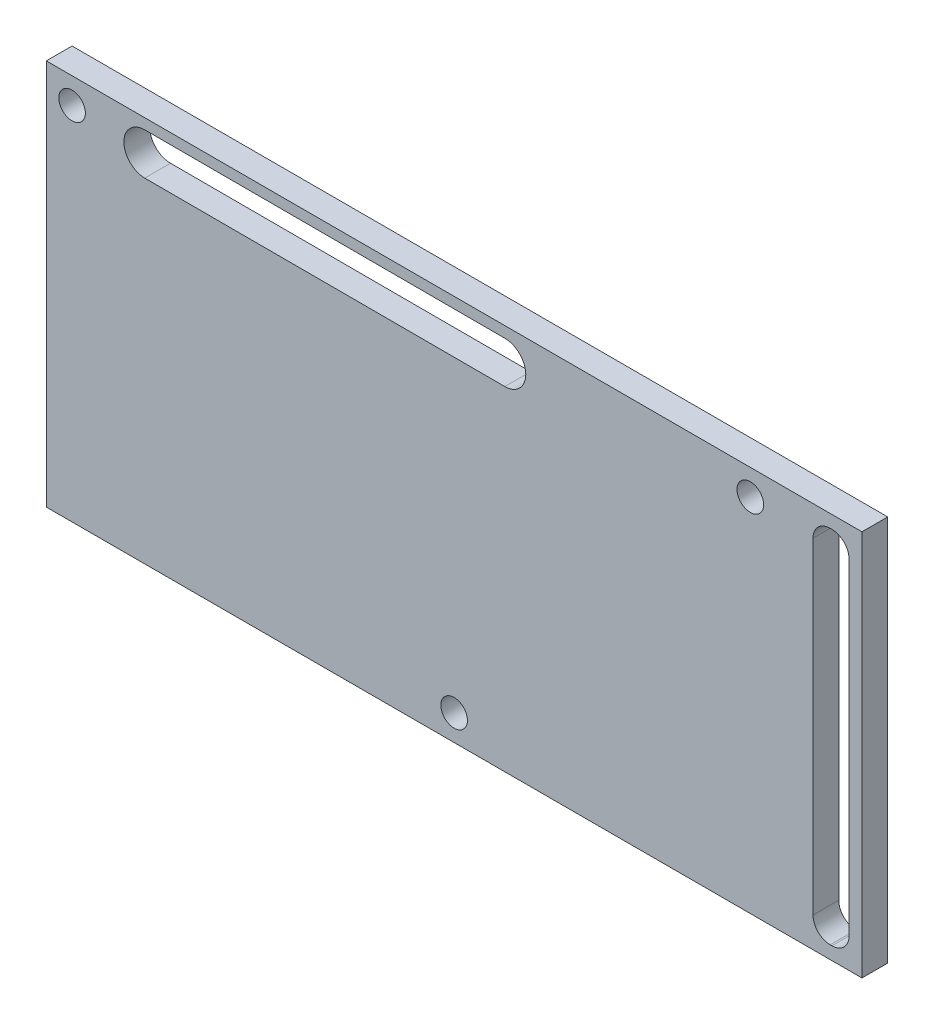
ISO-10303-21;
HEADER;
FILE_DESCRIPTION(('STEP AP214'),'2;1');
FILE_NAME('part.step','',(''),(''),'','','');
FILE_SCHEMA(('AUTOMOTIVE_DESIGN { 1 0 10303 214 1 1 1 1 }'));
ENDSEC;
DATA;
#1=APPLICATION_CONTEXT('core data for automotive mechanical design processes');
#2=APPLICATION_PROTOCOL_DEFINITION('international standard','automotive_design',2000,#1);
#3=PRODUCT_CONTEXT('',#1,'mechanical');
#4=PRODUCT('Part','Part','',(#3));
#5=PRODUCT_RELATED_PRODUCT_CATEGORY('part','',(#4));
#6=PRODUCT_DEFINITION_FORMATION('','',#4);
#7=PRODUCT_DEFINITION_CONTEXT('part definition',#1,'design');
#8=PRODUCT_DEFINITION('design','',#6,#7);
#9=PRODUCT_DEFINITION_SHAPE('','',#8);
#10=(LENGTH_UNIT() NAMED_UNIT(*) SI_UNIT(.MILLI.,.METRE.));
#11=(NAMED_UNIT(*) PLANE_ANGLE_UNIT() SI_UNIT($,.RADIAN.));
#12=(NAMED_UNIT(*) SI_UNIT($,.STERADIAN.) SOLID_ANGLE_UNIT());
#13=UNCERTAINTY_MEASURE_WITH_UNIT(LENGTH_MEASURE(1.E-05),#10,'distance_accuracy_value','');
#14=(GEOMETRIC_REPRESENTATION_CONTEXT(3) GLOBAL_UNCERTAINTY_ASSIGNED_CONTEXT((#13)) GLOBAL_UNIT_ASSIGNED_CONTEXT((#10,
#11,#12)) REPRESENTATION_CONTEXT('',''));
#15=CARTESIAN_POINT('',(0.,0.,0.));
#16=DIRECTION('',(0.,0.,1.));
#17=DIRECTION('',(1.,0.,0.));
#18=AXIS2_PLACEMENT_3D('',#15,#16,#17);
#19=CARTESIAN_POINT('',(0.,0.,3.));
#20=DIRECTION('',(0.,0.,1.));
#21=DIRECTION('',(1.,0.,0.));
#22=AXIS2_PLACEMENT_3D('',#19,#20,#21);
#23=PLANE('',#22);
#24=CARTESIAN_POINT('',(8.24073905983017,15.1157742275207,3.));
#25=DIRECTION('',(0.,0.,1.));
#26=DIRECTION('',(1.,0.,0.));
#27=AXIS2_PLACEMENT_3D('',#24,#25,#26);
#28=CIRCLE('',#27,1.54999944000001);
#29=CARTESIAN_POINT('',(9.79073849983018,15.1157742275207,3.));
#30=VERTEX_POINT('',#29);
#31=EDGE_CURVE('E249',#30,#30,#28,.T.);
#32=ORIENTED_EDGE('',*,*,#31,.F.);
#33=EDGE_LOOP('',(#32));
#34=FACE_BOUND('',#33,.T.);
#35=DIRECTION('',(0.,-1.,0.));
#36=VECTOR('',#35,1.);
#37=CARTESIAN_POINT('',(-39.2592599201698,57.1247740183707,3.));
#38=LINE('',#37,#36);
#39=CARTESIAN_POINT('',(-39.2592599201698,57.1247740183707,3.));
#40=VERTEX_POINT('',#39);
#41=CARTESIAN_POINT('',(-39.2592599201698,12.1157751475207,3.));
#42=VERTEX_POINT('',#41);
#43=EDGE_CURVE('E261',#40,#42,#38,.T.);
#44=ORIENTED_EDGE('',*,*,#43,.T.);
#45=DIRECTION('',(1.,0.,0.));
#46=VECTOR('',#45,1.);
#47=CARTESIAN_POINT('',(-39.2592599201698,12.1157751475207,3.));
#48=LINE('',#47,#46);
#49=CARTESIAN_POINT('',(55.7407400798302,12.1157751475207,3.));
#50=VERTEX_POINT('',#49);
#51=EDGE_CURVE('E264',#42,#50,#48,.T.);
#52=ORIENTED_EDGE('',*,*,#51,.T.);
#53=DIRECTION('',(0.,1.,0.));
#54=VECTOR('',#53,1.);
#55=CARTESIAN_POINT('',(55.7407400798302,12.1157751475207,3.));
#56=LINE('',#55,#54);
#57=CARTESIAN_POINT('',(55.7407400798302,57.1247740183707,3.));
#58=VERTEX_POINT('',#57);
#59=EDGE_CURVE('E267',#50,#58,#56,.T.);
#60=ORIENTED_EDGE('',*,*,#59,.T.);
#61=DIRECTION('',(-1.,0.,0.));
#62=VECTOR('',#61,1.);
#63=CARTESIAN_POINT('',(55.7407400798302,57.1247740183707,3.));
#64=LINE('',#63,#62);
#65=EDGE_CURVE('E269',#58,#40,#64,.T.);
#66=ORIENTED_EDGE('',*,*,#65,.T.);
#67=EDGE_LOOP('',(#44,#52,#60,#66));
#68=FACE_BOUND('',#67,.T.);
#69=CARTESIAN_POINT('',(42.7407411798302,54.1247740183707,3.));
#70=DIRECTION('',(0.,0.,1.));
#71=DIRECTION('',(1.,0.,0.));
#72=AXIS2_PLACEMENT_3D('',#69,#70,#71);
#73=CIRCLE('',#72,1.54999944);
#74=CARTESIAN_POINT('',(44.2907406198302,54.1247740183707,3.));
#75=VERTEX_POINT('',#74);
#76=EDGE_CURVE('E255',#75,#75,#73,.T.);
#77=ORIENTED_EDGE('',*,*,#76,.F.);
#78=EDGE_LOOP('',(#77));
#79=FACE_BOUND('',#78,.T.);
#80=CARTESIAN_POINT('',(-36.2592608401698,54.1247740183707,3.));
#81=DIRECTION('',(0.,0.,1.));
#82=DIRECTION('',(1.,0.,0.));
#83=AXIS2_PLACEMENT_3D('',#80,#81,#82);
#84=CIRCLE('',#83,1.54999943999998);
#85=CARTESIAN_POINT('',(-34.7092614001698,54.1247740183707,3.));
#86=VERTEX_POINT('',#85);
#87=EDGE_CURVE('E243',#86,#86,#84,.T.);
#88=ORIENTED_EDGE('',*,*,#87,.F.);
#89=EDGE_LOOP('',(#88));
#90=FACE_BOUND('',#89,.T.);
#91=DIRECTION('',(0.,-1.,0.));
#92=VECTOR('',#91,1.);
#93=CARTESIAN_POINT('',(50.0407400798302,53.6247740183707,3.));
#94=LINE('',#93,#92);
#95=CARTESIAN_POINT('',(50.0407400798302,53.6247740183707,3.));
#96=VERTEX_POINT('',#95);
#97=CARTESIAN_POINT('',(50.0407400798302,15.6157751475207,3.));
#98=VERTEX_POINT('',#97);
#99=EDGE_CURVE('E186',#96,#98,#94,.T.);
#100=ORIENTED_EDGE('',*,*,#99,.F.);
#101=CARTESIAN_POINT('',(52.0407400798302,53.6247740183707,3.));
#102=DIRECTION('',(0.,0.,1.));
#103=DIRECTION('',(1.,0.,0.));
#104=AXIS2_PLACEMENT_3D('',#101,#102,#103);
#105=CIRCLE('',#104,2.);
#106=CARTESIAN_POINT('',(52.0407400798302,55.6247740183707,3.));
#107=VERTEX_POINT('',#106);
#108=EDGE_CURVE('E184',#107,#96,#105,.T.);
#109=ORIENTED_EDGE('',*,*,#108,.F.);
#110=DIRECTION('',(-1.,0.,0.));
#111=VECTOR('',#110,1.);
#112=CARTESIAN_POINT('',(52.0407400798302,55.6247740183707,3.));
#113=LINE('',#112,#111);
#114=CARTESIAN_POINT('',(52.2407400798302,55.6247740183707,3.));
#115=VERTEX_POINT('',#114);
#116=EDGE_CURVE('E200',#115,#107,#113,.T.);
#117=ORIENTED_EDGE('',*,*,#116,.F.);
#118=CARTESIAN_POINT('',(52.2407400798302,53.6247740183707,3.));
#119=DIRECTION('',(0.,0.,1.));
#120=DIRECTION('',(-1.,0.,0.));
#121=AXIS2_PLACEMENT_3D('',#118,#119,#120);
#122=CIRCLE('',#121,2.);
#123=CARTESIAN_POINT('',(54.2407400798302,53.6247740183707,3.));
#124=VERTEX_POINT('',#123);
#125=EDGE_CURVE('E197',#124,#115,#122,.T.);
#126=ORIENTED_EDGE('',*,*,#125,.F.);
#127=DIRECTION('',(0.,1.,0.));
#128=VECTOR('',#127,1.);
#129=CARTESIAN_POINT('',(54.2407400798302,53.6247740183707,3.));
#130=LINE('',#129,#128);
#131=CARTESIAN_POINT('',(54.2407400798302,15.6157751475207,3.));
#132=VERTEX_POINT('',#131);
#133=EDGE_CURVE('E195',#132,#124,#130,.T.);
#134=ORIENTED_EDGE('',*,*,#133,.F.);
#135=CARTESIAN_POINT('',(52.2407400798302,15.6157751475207,3.));
#136=DIRECTION('',(0.,0.,1.));
#137=DIRECTION('',(1.,0.,0.));
#138=AXIS2_PLACEMENT_3D('',#135,#136,#137);
#139=CIRCLE('',#138,2.);
#140=CARTESIAN_POINT('',(52.2407400798302,13.6157751475207,3.));
#141=VERTEX_POINT('',#140);
#142=EDGE_CURVE('E193',#141,#132,#139,.T.);
#143=ORIENTED_EDGE('',*,*,#142,.F.);
#144=DIRECTION('',(1.,0.,0.));
#145=VECTOR('',#144,1.);
#146=CARTESIAN_POINT('',(52.0407400798302,13.6157751475207,3.));
#147=LINE('',#146,#145);
#148=CARTESIAN_POINT('',(52.0407400798302,13.6157751475207,3.));
#149=VERTEX_POINT('',#148);
#150=EDGE_CURVE('E191',#149,#141,#147,.T.);
#151=ORIENTED_EDGE('',*,*,#150,.F.);
#152=CARTESIAN_POINT('',(52.0407400798302,15.6157751475207,3.));
#153=DIRECTION('',(0.,0.,1.));
#154=DIRECTION('',(-1.,0.,0.));
#155=AXIS2_PLACEMENT_3D('',#152,#153,#154);
#156=CIRCLE('',#155,2.);
#157=EDGE_CURVE('E189',#98,#149,#156,.T.);
#158=ORIENTED_EDGE('',*,*,#157,.F.);
#159=EDGE_LOOP('',(#100,#109,#117,#126,#134,#143,#151,#158));
#160=FACE_BOUND('',#159,.T.);
#161=DIRECTION('',(-0.999999089913043,0.00134913790430462,0.));
#162=VECTOR('',#161,1.);
#163=CARTESIAN_POINT('',(14.1540236903263,55.8481032643427,3.));
#164=LINE('',#163,#162);
#165=CARTESIAN_POINT('',(14.1540236903263,55.8481032643427,3.));
#166=VERTEX_POINT('',#165);
#167=CARTESIAN_POINT('',(-27.781879960514,55.9046806329996,3.));
#168=VERTEX_POINT('',#167);
#169=EDGE_CURVE('E156',#166,#168,#164,.T.);
#170=ORIENTED_EDGE('',*,*,#169,.F.);
#171=CARTESIAN_POINT('',(14.1507379549645,53.4126721931049,3.));
#172=DIRECTION('',(0.,0.,1.));
#173=DIRECTION('',(1.,0.,0.));
#174=AXIS2_PLACEMENT_3D('',#171,#172,#173);
#175=CIRCLE('',#174,2.43543328769385);
#176=CARTESIAN_POINT('',(14.1474522196027,50.9772411218671,3.));
#177=VERTEX_POINT('',#176);
#178=EDGE_CURVE('E148',#177,#166,#175,.T.);
#179=ORIENTED_EDGE('',*,*,#178,.F.);
#180=DIRECTION('',(0.999999089913043,-0.00134913790430462,0.));
#181=VECTOR('',#180,1.);
#182=CARTESIAN_POINT('',(14.1474522196027,50.9772411218671,3.));
#183=LINE('',#182,#181);
#184=CARTESIAN_POINT('',(-27.7884514312376,51.0338184905241,3.));
#185=VERTEX_POINT('',#184);
#186=EDGE_CURVE('E170',#185,#177,#183,.T.);
#187=ORIENTED_EDGE('',*,*,#186,.F.);
#188=CARTESIAN_POINT('',(-27.7851656958758,53.4692495617618,3.));
#189=DIRECTION('',(0.,0.,1.));
#190=DIRECTION('',(1.,0.,0.));
#191=AXIS2_PLACEMENT_3D('',#188,#189,#190);
#192=CIRCLE('',#191,2.43543328769385);
#193=EDGE_CURVE('E168',#168,#185,#192,.T.);
#194=ORIENTED_EDGE('',*,*,#193,.F.);
#195=EDGE_LOOP('',(#170,#179,#187,#194));
#196=FACE_BOUND('',#195,.T.);
#197=ADVANCED_FACE('F35',(#34,#68,#79,#90,#160,#196),#23,.T.);
#198=CARTESIAN_POINT('',(0.,0.,0.));
#199=DIRECTION('',(0.,0.,1.));
#200=DIRECTION('',(1.,0.,0.));
#201=AXIS2_PLACEMENT_3D('',#198,#199,#200);
#202=PLANE('',#201);
#203=CARTESIAN_POINT('',(52.0407400798302,53.6247740183707,0.));
#204=DIRECTION('',(0.,0.,1.));
#205=DIRECTION('',(1.,0.,0.));
#206=AXIS2_PLACEMENT_3D('',#203,#204,#205);
#207=CIRCLE('',#206,2.);
#208=CARTESIAN_POINT('',(52.0407400798302,55.6247740183707,0.));
#209=VERTEX_POINT('',#208);
#210=CARTESIAN_POINT('',(50.0407400798302,53.6247740183707,0.));
#211=VERTEX_POINT('',#210);
#212=EDGE_CURVE('E164',#209,#211,#207,.T.);
#213=ORIENTED_EDGE('',*,*,#212,.T.);
#214=DIRECTION('',(0.,-1.,0.));
#215=VECTOR('',#214,1.);
#216=CARTESIAN_POINT('',(50.0407400798302,53.6247740183707,0.));
#217=LINE('',#216,#215);
#218=CARTESIAN_POINT('',(50.0407400798302,15.6157751475207,0.));
#219=VERTEX_POINT('',#218);
#220=EDGE_CURVE('E205',#211,#219,#217,.T.);
#221=ORIENTED_EDGE('',*,*,#220,.T.);
#222=CARTESIAN_POINT('',(52.0407400798302,15.6157751475207,0.));
#223=DIRECTION('',(0.,0.,1.));
#224=DIRECTION('',(-1.,0.,0.));
#225=AXIS2_PLACEMENT_3D('',#222,#223,#224);
#226=CIRCLE('',#225,2.);
#227=CARTESIAN_POINT('',(52.0407400798302,13.6157751475207,0.));
#228=VERTEX_POINT('',#227);
#229=EDGE_CURVE('E208',#219,#228,#226,.T.);
#230=ORIENTED_EDGE('',*,*,#229,.T.);
#231=DIRECTION('',(1.,0.,0.));
#232=VECTOR('',#231,1.);
#233=CARTESIAN_POINT('',(52.0407400798302,13.6157751475207,0.));
#234=LINE('',#233,#232);
#235=CARTESIAN_POINT('',(52.2407400798302,13.6157751475207,0.));
#236=VERTEX_POINT('',#235);
#237=EDGE_CURVE('E211',#228,#236,#234,.T.);
#238=ORIENTED_EDGE('',*,*,#237,.T.);
#239=CARTESIAN_POINT('',(52.2407400798302,15.6157751475207,0.));
#240=DIRECTION('',(0.,0.,1.));
#241=DIRECTION('',(1.,0.,0.));
#242=AXIS2_PLACEMENT_3D('',#239,#240,#241);
#243=CIRCLE('',#242,2.);
#244=CARTESIAN_POINT('',(54.2407400798302,15.6157751475207,0.));
#245=VERTEX_POINT('',#244);
#246=EDGE_CURVE('E214',#236,#245,#243,.T.);
#247=ORIENTED_EDGE('',*,*,#246,.T.);
#248=DIRECTION('',(0.,1.,0.));
#249=VECTOR('',#248,1.);
#250=CARTESIAN_POINT('',(54.2407400798302,53.6247740183707,0.));
#251=LINE('',#250,#249);
#252=CARTESIAN_POINT('',(54.2407400798302,53.6247740183707,0.));
#253=VERTEX_POINT('',#252);
#254=EDGE_CURVE('E217',#245,#253,#251,.T.);
#255=ORIENTED_EDGE('',*,*,#254,.T.);
#256=CARTESIAN_POINT('',(52.2407400798302,53.6247740183707,0.));
#257=DIRECTION('',(0.,0.,1.));
#258=DIRECTION('',(-1.,0.,0.));
#259=AXIS2_PLACEMENT_3D('',#256,#257,#258);
#260=CIRCLE('',#259,2.);
#261=CARTESIAN_POINT('',(52.2407400798302,55.6247740183707,0.));
#262=VERTEX_POINT('',#261);
#263=EDGE_CURVE('E220',#253,#262,#260,.T.);
#264=ORIENTED_EDGE('',*,*,#263,.T.);
#265=DIRECTION('',(-1.,0.,0.));
#266=VECTOR('',#265,1.);
#267=CARTESIAN_POINT('',(52.0407400798302,55.6247740183707,0.));
#268=LINE('',#267,#266);
#269=EDGE_CURVE('E187',#262,#209,#268,.T.);
#270=ORIENTED_EDGE('',*,*,#269,.T.);
#271=EDGE_LOOP('',(#213,#221,#230,#238,#247,#255,#264,#270));
#272=FACE_BOUND('',#271,.T.);
#273=DIRECTION('',(0.,-1.,0.));
#274=VECTOR('',#273,1.);
#275=CARTESIAN_POINT('',(-39.2592599201698,57.1247740183707,0.));
#276=LINE('',#275,#274);
#277=CARTESIAN_POINT('',(-39.2592599201698,57.1247740183707,0.));
#278=VERTEX_POINT('',#277);
#279=CARTESIAN_POINT('',(-39.2592599201698,12.1157751475207,0.));
#280=VERTEX_POINT('',#279);
#281=EDGE_CURVE('E258',#278,#280,#276,.T.);
#282=ORIENTED_EDGE('',*,*,#281,.F.);
#283=DIRECTION('',(-1.,0.,0.));
#284=VECTOR('',#283,1.);
#285=CARTESIAN_POINT('',(55.7407400798302,57.1247740183707,0.));
#286=LINE('',#285,#284);
#287=CARTESIAN_POINT('',(55.7407400798302,57.1247740183707,0.));
#288=VERTEX_POINT('',#287);
#289=EDGE_CURVE('E265',#288,#278,#286,.T.);
#290=ORIENTED_EDGE('',*,*,#289,.F.);
#291=DIRECTION('',(0.,1.,0.));
#292=VECTOR('',#291,1.);
#293=CARTESIAN_POINT('',(55.7407400798302,12.1157751475207,0.));
#294=LINE('',#293,#292);
#295=CARTESIAN_POINT('',(55.7407400798302,12.1157751475207,0.));
#296=VERTEX_POINT('',#295);
#297=EDGE_CURVE('E276',#296,#288,#294,.T.);
#298=ORIENTED_EDGE('',*,*,#297,.F.);
#299=DIRECTION('',(1.,0.,0.));
#300=VECTOR('',#299,1.);
#301=CARTESIAN_POINT('',(-39.2592599201698,12.1157751475207,0.));
#302=LINE('',#301,#300);
#303=EDGE_CURVE('E274',#280,#296,#302,.T.);
#304=ORIENTED_EDGE('',*,*,#303,.F.);
#305=EDGE_LOOP('',(#282,#290,#298,#304));
#306=FACE_BOUND('',#305,.T.);
#307=CARTESIAN_POINT('',(42.7407411798302,54.1247740183707,0.));
#308=DIRECTION('',(0.,0.,1.));
#309=DIRECTION('',(1.,0.,0.));
#310=AXIS2_PLACEMENT_3D('',#307,#308,#309);
#311=CIRCLE('',#310,1.54999944);
#312=CARTESIAN_POINT('',(44.2907406198302,54.1247740183707,0.));
#313=VERTEX_POINT('',#312);
#314=EDGE_CURVE('E252',#313,#313,#311,.T.);
#315=ORIENTED_EDGE('',*,*,#314,.T.);
#316=EDGE_LOOP('',(#315));
#317=FACE_BOUND('',#316,.T.);
#318=CARTESIAN_POINT('',(8.24073905983017,15.1157742275207,0.));
#319=DIRECTION('',(0.,0.,1.));
#320=DIRECTION('',(1.,0.,0.));
#321=AXIS2_PLACEMENT_3D('',#318,#319,#320);
#322=CIRCLE('',#321,1.54999944000001);
#323=CARTESIAN_POINT('',(9.79073849983018,15.1157742275207,0.));
#324=VERTEX_POINT('',#323);
#325=EDGE_CURVE('E246',#324,#324,#322,.T.);
#326=ORIENTED_EDGE('',*,*,#325,.T.);
#327=EDGE_LOOP('',(#326));
#328=FACE_BOUND('',#327,.T.);
#329=CARTESIAN_POINT('',(-36.2592608401698,54.1247740183707,0.));
#330=DIRECTION('',(0.,0.,1.));
#331=DIRECTION('',(1.,0.,0.));
#332=AXIS2_PLACEMENT_3D('',#329,#330,#331);
#333=CIRCLE('',#332,1.54999943999998);
#334=CARTESIAN_POINT('',(-34.7092614001698,54.1247740183707,0.));
#335=VERTEX_POINT('',#334);
#336=EDGE_CURVE('E242',#335,#335,#333,.T.);
#337=ORIENTED_EDGE('',*,*,#336,.T.);
#338=EDGE_LOOP('',(#337));
#339=FACE_BOUND('',#338,.T.);
#340=CARTESIAN_POINT('',(14.1507379549645,53.4126721931049,0.));
#341=DIRECTION('',(0.,0.,1.));
#342=DIRECTION('',(1.,0.,0.));
#343=AXIS2_PLACEMENT_3D('',#340,#341,#342);
#344=CIRCLE('',#343,2.43543328769385);
#345=CARTESIAN_POINT('',(14.1474522196027,50.9772411218671,0.));
#346=VERTEX_POINT('',#345);
#347=CARTESIAN_POINT('',(14.1540236903263,55.8481032643427,0.));
#348=VERTEX_POINT('',#347);
#349=EDGE_CURVE('E58',#346,#348,#344,.T.);
#350=ORIENTED_EDGE('',*,*,#349,.T.);
#351=DIRECTION('',(-0.999999089913043,0.00134913790430462,0.));
#352=VECTOR('',#351,1.);
#353=CARTESIAN_POINT('',(14.1540236903263,55.8481032643427,0.));
#354=LINE('',#353,#352);
#355=CARTESIAN_POINT('',(-27.781879960514,55.9046806329996,0.));
#356=VERTEX_POINT('',#355);
#357=EDGE_CURVE('E163',#348,#356,#354,.T.);
#358=ORIENTED_EDGE('',*,*,#357,.T.);
#359=CARTESIAN_POINT('',(-27.7851656958758,53.4692495617618,0.));
#360=DIRECTION('',(0.,0.,1.));
#361=DIRECTION('',(1.,0.,0.));
#362=AXIS2_PLACEMENT_3D('',#359,#360,#361);
#363=CIRCLE('',#362,2.43543328769385);
#364=CARTESIAN_POINT('',(-27.7884514312376,51.033818490524,0.));
#365=VERTEX_POINT('',#364);
#366=EDGE_CURVE('E176',#356,#365,#363,.T.);
#367=ORIENTED_EDGE('',*,*,#366,.T.);
#368=DIRECTION('',(0.999999089913043,-0.00134913790430462,0.));
#369=VECTOR('',#368,1.);
#370=CARTESIAN_POINT('',(14.1474522196027,50.9772411218671,0.));
#371=LINE('',#370,#369);
#372=EDGE_CURVE('E157',#365,#346,#371,.T.);
#373=ORIENTED_EDGE('',*,*,#372,.T.);
#374=EDGE_LOOP('',(#350,#358,#367,#373));
#375=FACE_BOUND('',#374,.T.);
#376=ADVANCED_FACE('F294',(#272,#306,#317,#328,#339,#375),#202,.F.);
#377=CARTESIAN_POINT('',(-39.2592599201698,57.1247740183707,3.));
#378=DIRECTION('',(1.,0.,0.));
#379=DIRECTION('',(0.,0.,-1.));
#380=AXIS2_PLACEMENT_3D('',#377,#378,#379);
#381=PLANE('',#380);
#382=ORIENTED_EDGE('',*,*,#281,.T.);
#383=DIRECTION('',(0.,0.,-1.));
#384=VECTOR('',#383,1.);
#385=CARTESIAN_POINT('',(-39.2592599201698,12.1157751475207,3.));
#386=LINE('',#385,#384);
#387=EDGE_CURVE('E11',#42,#280,#386,.T.);
#388=ORIENTED_EDGE('',*,*,#387,.F.);
#389=ORIENTED_EDGE('',*,*,#43,.F.);
#390=DIRECTION('',(0.,0.,-1.));
#391=VECTOR('',#390,1.);
#392=CARTESIAN_POINT('',(-39.2592599201698,57.1247740183707,3.));
#393=LINE('',#392,#391);
#394=EDGE_CURVE('E271',#40,#278,#393,.T.);
#395=ORIENTED_EDGE('',*,*,#394,.T.);
#396=EDGE_LOOP('',(#382,#388,#389,#395));
#397=FACE_BOUND('',#396,.T.);
#398=ADVANCED_FACE('F37',(#397),#381,.F.);
#399=CARTESIAN_POINT('',(-39.2592599201698,12.1157751475207,3.));
#400=DIRECTION('',(0.,1.,0.));
#401=DIRECTION('',(0.,0.,1.));
#402=AXIS2_PLACEMENT_3D('',#399,#400,#401);
#403=PLANE('',#402);
#404=ORIENTED_EDGE('',*,*,#303,.T.);
#405=DIRECTION('',(0.,0.,-1.));
#406=VECTOR('',#405,1.);
#407=CARTESIAN_POINT('',(55.7407400798302,12.1157751475207,3.));
#408=LINE('',#407,#406);
#409=EDGE_CURVE('E43',#50,#296,#408,.T.);
#410=ORIENTED_EDGE('',*,*,#409,.F.);
#411=ORIENTED_EDGE('',*,*,#51,.F.);
#412=ORIENTED_EDGE('',*,*,#387,.T.);
#413=EDGE_LOOP('',(#404,#410,#411,#412));
#414=FACE_BOUND('',#413,.T.);
#415=ADVANCED_FACE('F305',(#414),#403,.F.);
#416=CARTESIAN_POINT('',(55.7407400798302,12.1157751475207,3.));
#417=DIRECTION('',(-1.,0.,0.));
#418=DIRECTION('',(0.,0.,1.));
#419=AXIS2_PLACEMENT_3D('',#416,#417,#418);
#420=PLANE('',#419);
#421=ORIENTED_EDGE('',*,*,#297,.T.);
#422=DIRECTION('',(0.,0.,-1.));
#423=VECTOR('',#422,1.);
#424=CARTESIAN_POINT('',(55.7407400798302,57.1247740183707,3.));
#425=LINE('',#424,#423);
#426=EDGE_CURVE('E281',#58,#288,#425,.T.);
#427=ORIENTED_EDGE('',*,*,#426,.F.);
#428=ORIENTED_EDGE('',*,*,#59,.F.);
#429=ORIENTED_EDGE('',*,*,#409,.T.);
#430=EDGE_LOOP('',(#421,#427,#428,#429));
#431=FACE_BOUND('',#430,.T.);
#432=ADVANCED_FACE('F288',(#431),#420,.F.);
#433=CARTESIAN_POINT('',(55.7407400798302,57.1247740183707,3.));
#434=DIRECTION('',(0.,-1.,0.));
#435=DIRECTION('',(1.,0.,0.));
#436=AXIS2_PLACEMENT_3D('',#433,#434,#435);
#437=PLANE('',#436);
#438=ORIENTED_EDGE('',*,*,#289,.T.);
#439=ORIENTED_EDGE('',*,*,#394,.F.);
#440=ORIENTED_EDGE('',*,*,#65,.F.);
#441=ORIENTED_EDGE('',*,*,#426,.T.);
#442=EDGE_LOOP('',(#438,#439,#440,#441));
#443=FACE_BOUND('',#442,.T.);
#444=ADVANCED_FACE('F298',(#443),#437,.F.);
#445=CARTESIAN_POINT('',(42.7407411798302,54.1247740183707,3.));
#446=DIRECTION('',(0.,0.,-1.));
#447=DIRECTION('',(-1.,0.,0.));
#448=AXIS2_PLACEMENT_3D('',#445,#446,#447);
#449=CYLINDRICAL_SURFACE('',#448,1.54999944);
#450=ORIENTED_EDGE('',*,*,#76,.T.);
#451=EDGE_LOOP('',(#450));
#452=FACE_BOUND('',#451,.T.);
#453=ORIENTED_EDGE('',*,*,#314,.F.);
#454=EDGE_LOOP('',(#453));
#455=FACE_BOUND('',#454,.T.);
#456=ADVANCED_FACE('F322',(#452,#455),#449,.F.);
#457=CARTESIAN_POINT('',(8.24073905983017,15.1157742275207,3.));
#458=DIRECTION('',(0.,0.,-1.));
#459=DIRECTION('',(-1.,0.,0.));
#460=AXIS2_PLACEMENT_3D('',#457,#458,#459);
#461=CYLINDRICAL_SURFACE('',#460,1.54999944000001);
#462=ORIENTED_EDGE('',*,*,#31,.T.);
#463=EDGE_LOOP('',(#462));
#464=FACE_BOUND('',#463,.T.);
#465=ORIENTED_EDGE('',*,*,#325,.F.);
#466=EDGE_LOOP('',(#465));
#467=FACE_BOUND('',#466,.T.);
#468=ADVANCED_FACE('F329',(#464,#467),#461,.F.);
#469=CARTESIAN_POINT('',(-36.2592608401698,54.1247740183707,3.));
#470=DIRECTION('',(0.,0.,-1.));
#471=DIRECTION('',(-1.,0.,0.));
#472=AXIS2_PLACEMENT_3D('',#469,#470,#471);
#473=CYLINDRICAL_SURFACE('',#472,1.54999943999998);
#474=ORIENTED_EDGE('',*,*,#87,.T.);
#475=EDGE_LOOP('',(#474));
#476=FACE_BOUND('',#475,.T.);
#477=ORIENTED_EDGE('',*,*,#336,.F.);
#478=EDGE_LOOP('',(#477));
#479=FACE_BOUND('',#478,.T.);
#480=ADVANCED_FACE('F334',(#476,#479),#473,.F.);
#481=CARTESIAN_POINT('',(52.0407400798302,53.6247740183707,3.));
#482=DIRECTION('',(0.,0.,-1.));
#483=DIRECTION('',(-1.,0.,0.));
#484=AXIS2_PLACEMENT_3D('',#481,#482,#483);
#485=CYLINDRICAL_SURFACE('',#484,2.);
#486=ORIENTED_EDGE('',*,*,#212,.F.);
#487=DIRECTION('',(0.,0.,-1.));
#488=VECTOR('',#487,1.);
#489=CARTESIAN_POINT('',(52.0407400798302,55.6247740183707,3.));
#490=LINE('',#489,#488);
#491=EDGE_CURVE('E202',#107,#209,#490,.T.);
#492=ORIENTED_EDGE('',*,*,#491,.F.);
#493=ORIENTED_EDGE('',*,*,#108,.T.);
#494=DIRECTION('',(0.,0.,-1.));
#495=VECTOR('',#494,1.);
#496=CARTESIAN_POINT('',(50.0407400798302,53.6247740183707,3.));
#497=LINE('',#496,#495);
#498=EDGE_CURVE('E239',#96,#211,#497,.T.);
#499=ORIENTED_EDGE('',*,*,#498,.T.);
#500=EDGE_LOOP('',(#486,#492,#493,#499));
#501=FACE_BOUND('',#500,.T.);
#502=ADVANCED_FACE('F386',(#501),#485,.F.);
#503=CARTESIAN_POINT('',(50.0407400798302,53.6247740183707,3.));
#504=DIRECTION('',(1.,0.,0.));
#505=DIRECTION('',(0.,0.,-1.));
#506=AXIS2_PLACEMENT_3D('',#503,#504,#505);
#507=PLANE('',#506);
#508=ORIENTED_EDGE('',*,*,#220,.F.);
#509=ORIENTED_EDGE('',*,*,#498,.F.);
#510=ORIENTED_EDGE('',*,*,#99,.T.);
#511=DIRECTION('',(0.,0.,-1.));
#512=VECTOR('',#511,1.);
#513=CARTESIAN_POINT('',(50.0407400798302,15.6157751475207,3.));
#514=LINE('',#513,#512);
#515=EDGE_CURVE('E237',#98,#219,#514,.T.);
#516=ORIENTED_EDGE('',*,*,#515,.T.);
#517=EDGE_LOOP('',(#508,#509,#510,#516));
#518=FACE_BOUND('',#517,.T.);
#519=ADVANCED_FACE('F382',(#518),#507,.T.);
#520=CARTESIAN_POINT('',(52.0407400798302,15.6157751475207,3.));
#521=DIRECTION('',(0.,0.,-1.));
#522=DIRECTION('',(-1.,0.,0.));
#523=AXIS2_PLACEMENT_3D('',#520,#521,#522);
#524=CYLINDRICAL_SURFACE('',#523,2.);
#525=ORIENTED_EDGE('',*,*,#229,.F.);
#526=ORIENTED_EDGE('',*,*,#515,.F.);
#527=ORIENTED_EDGE('',*,*,#157,.T.);
#528=DIRECTION('',(0.,0.,-1.));
#529=VECTOR('',#528,1.);
#530=CARTESIAN_POINT('',(52.0407400798302,13.6157751475207,3.));
#531=LINE('',#530,#529);
#532=EDGE_CURVE('E235',#149,#228,#531,.T.);
#533=ORIENTED_EDGE('',*,*,#532,.T.);
#534=EDGE_LOOP('',(#525,#526,#527,#533));
#535=FACE_BOUND('',#534,.T.);
#536=ADVANCED_FACE('F378',(#535),#524,.F.);
#537=CARTESIAN_POINT('',(52.0407400798302,13.6157751475207,3.));
#538=DIRECTION('',(0.,1.,0.));
#539=DIRECTION('',(0.,0.,1.));
#540=AXIS2_PLACEMENT_3D('',#537,#538,#539);
#541=PLANE('',#540);
#542=ORIENTED_EDGE('',*,*,#237,.F.);
#543=ORIENTED_EDGE('',*,*,#532,.F.);
#544=ORIENTED_EDGE('',*,*,#150,.T.);
#545=DIRECTION('',(0.,0.,-1.));
#546=VECTOR('',#545,1.);
#547=CARTESIAN_POINT('',(52.2407400798302,13.6157751475207,3.));
#548=LINE('',#547,#546);
#549=EDGE_CURVE('E233',#141,#236,#548,.T.);
#550=ORIENTED_EDGE('',*,*,#549,.T.);
#551=EDGE_LOOP('',(#542,#543,#544,#550));
#552=FACE_BOUND('',#551,.T.);
#553=ADVANCED_FACE('F374',(#552),#541,.T.);
#554=CARTESIAN_POINT('',(52.2407400798302,15.6157751475207,3.));
#555=DIRECTION('',(0.,0.,-1.));
#556=DIRECTION('',(-1.,0.,0.));
#557=AXIS2_PLACEMENT_3D('',#554,#555,#556);
#558=CYLINDRICAL_SURFACE('',#557,2.);
#559=ORIENTED_EDGE('',*,*,#246,.F.);
#560=ORIENTED_EDGE('',*,*,#549,.F.);
#561=ORIENTED_EDGE('',*,*,#142,.T.);
#562=DIRECTION('',(0.,0.,-1.));
#563=VECTOR('',#562,1.);
#564=CARTESIAN_POINT('',(54.2407400798302,15.6157751475207,3.));
#565=LINE('',#564,#563);
#566=EDGE_CURVE('E231',#132,#245,#565,.T.);
#567=ORIENTED_EDGE('',*,*,#566,.T.);
#568=EDGE_LOOP('',(#559,#560,#561,#567));
#569=FACE_BOUND('',#568,.T.);
#570=ADVANCED_FACE('F370',(#569),#558,.F.);
#571=CARTESIAN_POINT('',(54.2407400798302,53.6247740183707,3.));
#572=DIRECTION('',(-1.,0.,0.));
#573=DIRECTION('',(0.,-1.,0.));
#574=AXIS2_PLACEMENT_3D('',#571,#572,#573);
#575=PLANE('',#574);
#576=ORIENTED_EDGE('',*,*,#254,.F.);
#577=ORIENTED_EDGE('',*,*,#566,.F.);
#578=ORIENTED_EDGE('',*,*,#133,.T.);
#579=DIRECTION('',(0.,0.,-1.));
#580=VECTOR('',#579,1.);
#581=CARTESIAN_POINT('',(54.2407400798302,53.6247740183707,3.));
#582=LINE('',#581,#580);
#583=EDGE_CURVE('E229',#124,#253,#582,.T.);
#584=ORIENTED_EDGE('',*,*,#583,.T.);
#585=EDGE_LOOP('',(#576,#577,#578,#584));
#586=FACE_BOUND('',#585,.T.);
#587=ADVANCED_FACE('F366',(#586),#575,.T.);
#588=CARTESIAN_POINT('',(52.2407400798302,53.6247740183707,3.));
#589=DIRECTION('',(0.,0.,-1.));
#590=DIRECTION('',(-1.,0.,0.));
#591=AXIS2_PLACEMENT_3D('',#588,#589,#590);
#592=CYLINDRICAL_SURFACE('',#591,2.);
#593=ORIENTED_EDGE('',*,*,#263,.F.);
#594=ORIENTED_EDGE('',*,*,#583,.F.);
#595=ORIENTED_EDGE('',*,*,#125,.T.);
#596=DIRECTION('',(0.,0.,-1.));
#597=VECTOR('',#596,1.);
#598=CARTESIAN_POINT('',(52.2407400798302,55.6247740183707,3.));
#599=LINE('',#598,#597);
#600=EDGE_CURVE('E227',#115,#262,#599,.T.);
#601=ORIENTED_EDGE('',*,*,#600,.T.);
#602=EDGE_LOOP('',(#593,#594,#595,#601));
#603=FACE_BOUND('',#602,.T.);
#604=ADVANCED_FACE('F362',(#603),#592,.F.);
#605=CARTESIAN_POINT('',(52.0407400798302,55.6247740183707,3.));
#606=DIRECTION('',(0.,-1.,0.));
#607=DIRECTION('',(0.,0.,-1.));
#608=AXIS2_PLACEMENT_3D('',#605,#606,#607);
#609=PLANE('',#608);
#610=ORIENTED_EDGE('',*,*,#269,.F.);
#611=ORIENTED_EDGE('',*,*,#600,.F.);
#612=ORIENTED_EDGE('',*,*,#116,.T.);
#613=ORIENTED_EDGE('',*,*,#491,.T.);
#614=EDGE_LOOP('',(#610,#611,#612,#613));
#615=FACE_BOUND('',#614,.T.);
#616=ADVANCED_FACE('F359',(#615),#609,.T.);
#617=CARTESIAN_POINT('',(14.1507379549645,53.4126721931049,3.));
#618=DIRECTION('',(0.,0.,-1.));
#619=DIRECTION('',(-1.,0.,0.));
#620=AXIS2_PLACEMENT_3D('',#617,#618,#619);
#621=CYLINDRICAL_SURFACE('',#620,2.43543328769385);
#622=ORIENTED_EDGE('',*,*,#349,.F.);
#623=DIRECTION('',(0.,0.,-1.));
#624=VECTOR('',#623,1.);
#625=CARTESIAN_POINT('',(14.1474522196027,50.9772411218671,3.));
#626=LINE('',#625,#624);
#627=EDGE_CURVE('E152',#177,#346,#626,.T.);
#628=ORIENTED_EDGE('',*,*,#627,.F.);
#629=ORIENTED_EDGE('',*,*,#178,.T.);
#630=DIRECTION('',(0.,0.,-1.));
#631=VECTOR('',#630,1.);
#632=CARTESIAN_POINT('',(14.1540236903263,55.8481032643427,3.));
#633=LINE('',#632,#631);
#634=EDGE_CURVE('E151',#166,#348,#633,.T.);
#635=ORIENTED_EDGE('',*,*,#634,.T.);
#636=EDGE_LOOP('',(#622,#628,#629,#635));
#637=FACE_BOUND('',#636,.T.);
#638=ADVANCED_FACE('F150',(#637),#621,.F.);
#639=CARTESIAN_POINT('',(14.1540236903263,55.8481032643427,3.));
#640=DIRECTION('',(-0.00134913790430462,-0.999999089913043,0.));
#641=DIRECTION('',(0.999999089913044,-0.00134913790430462,0.));
#642=AXIS2_PLACEMENT_3D('',#639,#640,#641);
#643=PLANE('',#642);
#644=ORIENTED_EDGE('',*,*,#357,.F.);
#645=ORIENTED_EDGE('',*,*,#634,.F.);
#646=ORIENTED_EDGE('',*,*,#169,.T.);
#647=DIRECTION('',(0.,0.,-1.));
#648=VECTOR('',#647,1.);
#649=CARTESIAN_POINT('',(-27.781879960514,55.9046806329996,3.));
#650=LINE('',#649,#648);
#651=EDGE_CURVE('E165',#168,#356,#650,.T.);
#652=ORIENTED_EDGE('',*,*,#651,.T.);
#653=EDGE_LOOP('',(#644,#645,#646,#652));
#654=FACE_BOUND('',#653,.T.);
#655=ADVANCED_FACE('F160',(#654),#643,.T.);
#656=CARTESIAN_POINT('',(-27.7851656958758,53.4692495617618,3.));
#657=DIRECTION('',(0.,0.,-1.));
#658=DIRECTION('',(-1.,0.,0.));
#659=AXIS2_PLACEMENT_3D('',#656,#657,#658);
#660=CYLINDRICAL_SURFACE('',#659,2.43543328769385);
#661=ORIENTED_EDGE('',*,*,#366,.F.);
#662=ORIENTED_EDGE('',*,*,#651,.F.);
#663=ORIENTED_EDGE('',*,*,#193,.T.);
#664=DIRECTION('',(0.,0.,-1.));
#665=VECTOR('',#664,1.);
#666=CARTESIAN_POINT('',(-27.7884514312376,51.033818490524,3.));
#667=LINE('',#666,#665);
#668=EDGE_CURVE('E50',#185,#365,#667,.T.);
#669=ORIENTED_EDGE('',*,*,#668,.T.);
#670=EDGE_LOOP('',(#661,#662,#663,#669));
#671=FACE_BOUND('',#670,.T.);
#672=ADVANCED_FACE('F347',(#671),#660,.F.);
#673=CARTESIAN_POINT('',(14.1474522196027,50.9772411218671,3.));
#674=DIRECTION('',(0.00134913790430462,0.999999089913043,0.));
#675=DIRECTION('',(-0.999999089913044,0.00134913790430462,0.));
#676=AXIS2_PLACEMENT_3D('',#673,#674,#675);
#677=PLANE('',#676);
#678=ORIENTED_EDGE('',*,*,#372,.F.);
#679=ORIENTED_EDGE('',*,*,#668,.F.);
#680=ORIENTED_EDGE('',*,*,#186,.T.);
#681=ORIENTED_EDGE('',*,*,#627,.T.);
#682=EDGE_LOOP('',(#678,#679,#680,#681));
#683=FACE_BOUND('',#682,.T.);
#684=ADVANCED_FACE('F345',(#683),#677,.T.);
#685=CLOSED_SHELL('',(#197,#376,#398,#415,#432,#444,#456,#468,#480,#502,#519,#536,#553,#570,
#587,#604,#616,#638,#655,#672,#684));
#686=MANIFOLD_SOLID_BREP('B2',#685);
#687=ADVANCED_BREP_SHAPE_REPRESENTATION('',(#18,#686),#14);
#688=SHAPE_DEFINITION_REPRESENTATION(#9,#687);
ENDSEC;
END-ISO-10303-21;
